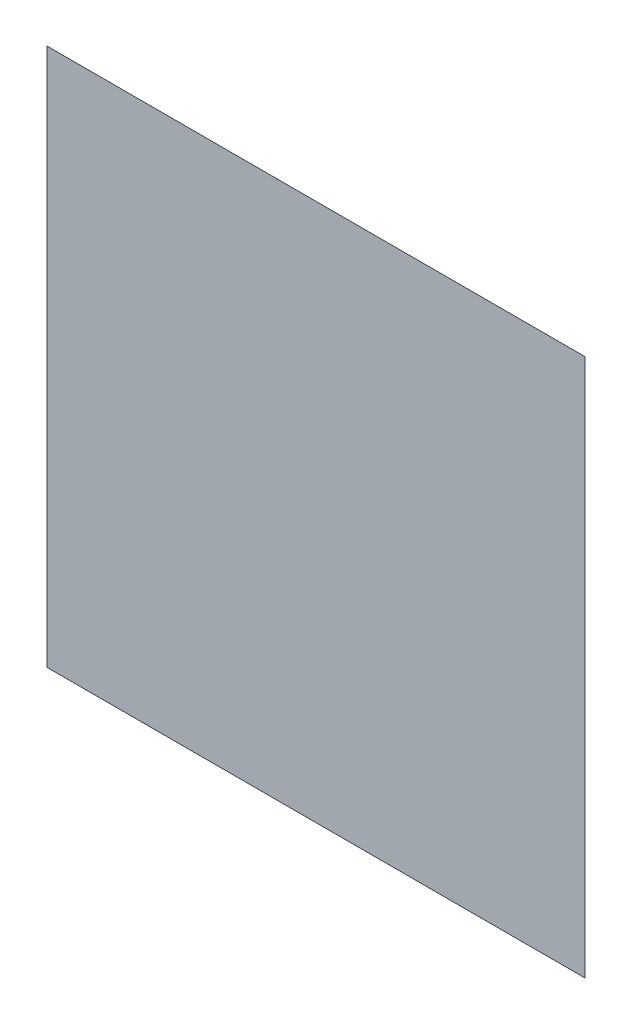
ISO-10303-21;
HEADER;
FILE_DESCRIPTION(('STEP AP214'),'2;1');
FILE_NAME('part.step','',(''),(''),'','','');
FILE_SCHEMA(('AUTOMOTIVE_DESIGN { 1 0 10303 214 1 1 1 1 }'));
ENDSEC;
DATA;
#1=APPLICATION_CONTEXT('core data for automotive mechanical design processes');
#2=APPLICATION_PROTOCOL_DEFINITION('international standard','automotive_design',2000,#1);
#3=PRODUCT_CONTEXT('',#1,'mechanical');
#4=PRODUCT('Part','Part','',(#3));
#5=PRODUCT_RELATED_PRODUCT_CATEGORY('part','',(#4));
#6=PRODUCT_DEFINITION_FORMATION('','',#4);
#7=PRODUCT_DEFINITION_CONTEXT('part definition',#1,'design');
#8=PRODUCT_DEFINITION('design','',#6,#7);
#9=PRODUCT_DEFINITION_SHAPE('','',#8);
#10=(LENGTH_UNIT() NAMED_UNIT(*) SI_UNIT(.MILLI.,.METRE.));
#11=(NAMED_UNIT(*) PLANE_ANGLE_UNIT() SI_UNIT($,.RADIAN.));
#12=(NAMED_UNIT(*) SI_UNIT($,.STERADIAN.) SOLID_ANGLE_UNIT());
#13=UNCERTAINTY_MEASURE_WITH_UNIT(LENGTH_MEASURE(1.E-05),#10,'distance_accuracy_value','');
#14=(GEOMETRIC_REPRESENTATION_CONTEXT(3) GLOBAL_UNCERTAINTY_ASSIGNED_CONTEXT((#13)) GLOBAL_UNIT_ASSIGNED_CONTEXT((#10,
#11,#12)) REPRESENTATION_CONTEXT('',''));
#15=CARTESIAN_POINT('',(0.,0.,0.));
#16=DIRECTION('',(0.,0.,1.));
#17=DIRECTION('',(1.,0.,0.));
#18=AXIS2_PLACEMENT_3D('',#15,#16,#17);
#19=CARTESIAN_POINT('',(-454.545454545454,-606.060606060606,0.001));
#20=DIRECTION('',(0.,1.,0.));
#21=DIRECTION('',(0.,0.,1.));
#22=AXIS2_PLACEMENT_3D('',#19,#20,#21);
#23=PLANE('',#22);
#24=DIRECTION('',(1.,0.,0.));
#25=VECTOR('',#24,1.);
#26=CARTESIAN_POINT('',(-454.545454545454,-606.060606060606,0.));
#27=LINE('',#26,#25);
#28=CARTESIAN_POINT('',(-454.545454545454,-606.060606060606,0.));
#29=VERTEX_POINT('',#28);
#30=CARTESIAN_POINT('',(545.454545454546,-606.060606060606,0.));
#31=VERTEX_POINT('',#30);
#32=EDGE_CURVE('E98',#29,#31,#27,.T.);
#33=ORIENTED_EDGE('',*,*,#32,.T.);
#34=DIRECTION('',(0.,0.,-1.));
#35=VECTOR('',#34,1.);
#36=CARTESIAN_POINT('',(545.454545454546,-606.060606060606,0.001));
#37=LINE('',#36,#35);
#38=CARTESIAN_POINT('',(545.454545454546,-606.060606060606,0.001));
#39=VERTEX_POINT('',#38);
#40=EDGE_CURVE('E11',#39,#31,#37,.T.);
#41=ORIENTED_EDGE('',*,*,#40,.F.);
#42=DIRECTION('',(1.,0.,0.));
#43=VECTOR('',#42,1.);
#44=CARTESIAN_POINT('',(-454.545454545454,-606.060606060606,0.001));
#45=LINE('',#44,#43);
#46=CARTESIAN_POINT('',(-454.545454545454,-606.060606060606,0.001));
#47=VERTEX_POINT('',#46);
#48=EDGE_CURVE('E75',#47,#39,#45,.T.);
#49=ORIENTED_EDGE('',*,*,#48,.F.);
#50=DIRECTION('',(0.,0.,-1.));
#51=VECTOR('',#50,1.);
#52=CARTESIAN_POINT('',(-454.545454545454,-606.060606060606,0.001));
#53=LINE('',#52,#51);
#54=EDGE_CURVE('E94',#47,#29,#53,.T.);
#55=ORIENTED_EDGE('',*,*,#54,.T.);
#56=EDGE_LOOP('',(#33,#41,#49,#55));
#57=FACE_BOUND('',#56,.T.);
#58=ADVANCED_FACE('F36',(#57),#23,.F.);
#59=CARTESIAN_POINT('',(545.454545454545,393.939393939394,0.001));
#60=DIRECTION('',(1.,0.,0.));
#61=DIRECTION('',(0.,1.,0.));
#62=AXIS2_PLACEMENT_3D('',#59,#60,#61);
#63=PLANE('',#62);
#64=DIRECTION('',(0.,-1.,0.));
#65=VECTOR('',#64,1.);
#66=CARTESIAN_POINT('',(545.454545454545,393.939393939394,0.));
#67=LINE('',#66,#65);
#68=CARTESIAN_POINT('',(545.454545454545,393.939393939394,0.));
#69=VERTEX_POINT('',#68);
#70=EDGE_CURVE('E84',#69,#31,#67,.T.);
#71=ORIENTED_EDGE('',*,*,#70,.F.);
#72=DIRECTION('',(0.,0.,-1.));
#73=VECTOR('',#72,1.);
#74=CARTESIAN_POINT('',(545.454545454545,393.939393939394,0.001));
#75=LINE('',#74,#73);
#76=CARTESIAN_POINT('',(545.454545454545,393.939393939394,0.001));
#77=VERTEX_POINT('',#76);
#78=EDGE_CURVE('E44',#77,#69,#75,.T.);
#79=ORIENTED_EDGE('',*,*,#78,.F.);
#80=DIRECTION('',(0.,-1.,0.));
#81=VECTOR('',#80,1.);
#82=CARTESIAN_POINT('',(545.454545454545,393.939393939394,0.001));
#83=LINE('',#82,#81);
#84=EDGE_CURVE('E82',#77,#39,#83,.T.);
#85=ORIENTED_EDGE('',*,*,#84,.T.);
#86=ORIENTED_EDGE('',*,*,#40,.T.);
#87=EDGE_LOOP('',(#71,#79,#85,#86));
#88=FACE_BOUND('',#87,.T.);
#89=ADVANCED_FACE('F81',(#88),#63,.T.);
#90=CARTESIAN_POINT('',(-454.545454545454,393.939393939394,0.001));
#91=DIRECTION('',(0.,1.,0.));
#92=DIRECTION('',(0.,0.,1.));
#93=AXIS2_PLACEMENT_3D('',#90,#91,#92);
#94=PLANE('',#93);
#95=DIRECTION('',(1.,0.,0.));
#96=VECTOR('',#95,1.);
#97=CARTESIAN_POINT('',(-454.545454545454,393.939393939394,0.));
#98=LINE('',#97,#96);
#99=CARTESIAN_POINT('',(-454.545454545454,393.939393939394,0.));
#100=VERTEX_POINT('',#99);
#101=EDGE_CURVE('E102',#100,#69,#98,.T.);
#102=ORIENTED_EDGE('',*,*,#101,.F.);
#103=DIRECTION('',(0.,0.,-1.));
#104=VECTOR('',#103,1.);
#105=CARTESIAN_POINT('',(-454.545454545454,393.939393939394,0.001));
#106=LINE('',#105,#104);
#107=CARTESIAN_POINT('',(-454.545454545454,393.939393939394,0.001));
#108=VERTEX_POINT('',#107);
#109=EDGE_CURVE('E67',#108,#100,#106,.T.);
#110=ORIENTED_EDGE('',*,*,#109,.F.);
#111=DIRECTION('',(1.,0.,0.));
#112=VECTOR('',#111,1.);
#113=CARTESIAN_POINT('',(-454.545454545454,393.939393939394,0.001));
#114=LINE('',#113,#112);
#115=EDGE_CURVE('E90',#108,#77,#114,.T.);
#116=ORIENTED_EDGE('',*,*,#115,.T.);
#117=ORIENTED_EDGE('',*,*,#78,.T.);
#118=EDGE_LOOP('',(#102,#110,#116,#117));
#119=FACE_BOUND('',#118,.T.);
#120=ADVANCED_FACE('F92',(#119),#94,.T.);
#121=CARTESIAN_POINT('',(-454.545454545454,393.939393939394,0.001));
#122=DIRECTION('',(1.,0.,0.));
#123=DIRECTION('',(0.,1.,0.));
#124=AXIS2_PLACEMENT_3D('',#121,#122,#123);
#125=PLANE('',#124);
#126=DIRECTION('',(0.,-1.,0.));
#127=VECTOR('',#126,1.);
#128=CARTESIAN_POINT('',(-454.545454545454,393.939393939394,0.));
#129=LINE('',#128,#127);
#130=EDGE_CURVE('E70',#100,#29,#129,.T.);
#131=ORIENTED_EDGE('',*,*,#130,.T.);
#132=ORIENTED_EDGE('',*,*,#54,.F.);
#133=DIRECTION('',(0.,-1.,0.));
#134=VECTOR('',#133,1.);
#135=CARTESIAN_POINT('',(-454.545454545454,393.939393939394,0.001));
#136=LINE('',#135,#134);
#137=EDGE_CURVE('E52',#108,#47,#136,.T.);
#138=ORIENTED_EDGE('',*,*,#137,.F.);
#139=ORIENTED_EDGE('',*,*,#109,.T.);
#140=EDGE_LOOP('',(#131,#132,#138,#139));
#141=FACE_BOUND('',#140,.T.);
#142=ADVANCED_FACE('F115',(#141),#125,.F.);
#143=CARTESIAN_POINT('',(0.,0.,0.001));
#144=DIRECTION('',(0.,0.,-1.));
#145=DIRECTION('',(-1.,0.,0.));
#146=AXIS2_PLACEMENT_3D('',#143,#144,#145);
#147=PLANE('',#146);
#148=ORIENTED_EDGE('',*,*,#48,.T.);
#149=ORIENTED_EDGE('',*,*,#84,.F.);
#150=ORIENTED_EDGE('',*,*,#115,.F.);
#151=ORIENTED_EDGE('',*,*,#137,.T.);
#152=EDGE_LOOP('',(#148,#149,#150,#151));
#153=FACE_BOUND('',#152,.T.);
#154=ADVANCED_FACE('F89',(#153),#147,.F.);
#155=CARTESIAN_POINT('',(0.,0.,0.));
#156=DIRECTION('',(0.,0.,-1.));
#157=DIRECTION('',(-1.,0.,0.));
#158=AXIS2_PLACEMENT_3D('',#155,#156,#157);
#159=PLANE('',#158);
#160=ORIENTED_EDGE('',*,*,#32,.F.);
#161=ORIENTED_EDGE('',*,*,#130,.F.);
#162=ORIENTED_EDGE('',*,*,#101,.T.);
#163=ORIENTED_EDGE('',*,*,#70,.T.);
#164=EDGE_LOOP('',(#160,#161,#162,#163));
#165=FACE_BOUND('',#164,.T.);
#166=ADVANCED_FACE('F109',(#165),#159,.T.);
#167=CLOSED_SHELL('',(#58,#89,#120,#142,#154,#166));
#168=MANIFOLD_SOLID_BREP('B2',#167);
#169=ADVANCED_BREP_SHAPE_REPRESENTATION('',(#18,#168),#14);
#170=SHAPE_DEFINITION_REPRESENTATION(#9,#169);
ENDSEC;
END-ISO-10303-21;
